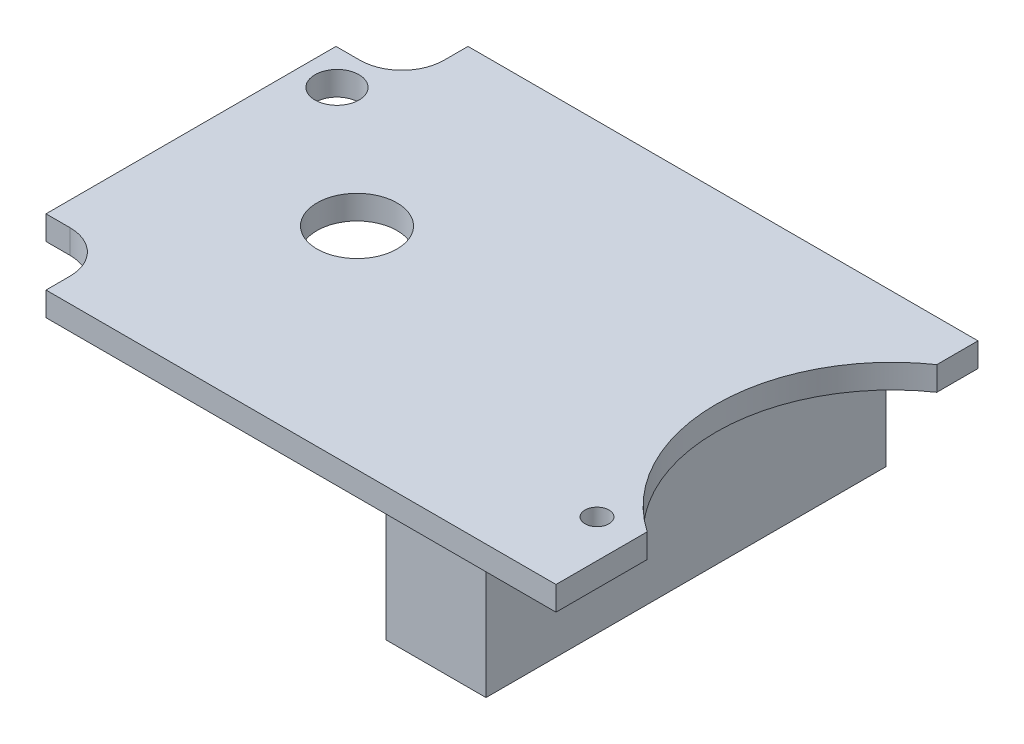
ISO-10303-21;
HEADER;
FILE_DESCRIPTION(('STEP AP214'),'2;1');
FILE_NAME('part.step','',(''),(''),'','','');
FILE_SCHEMA(('AUTOMOTIVE_DESIGN { 1 0 10303 214 1 1 1 1 }'));
ENDSEC;
DATA;
#1=APPLICATION_CONTEXT('core data for automotive mechanical design processes');
#2=APPLICATION_PROTOCOL_DEFINITION('international standard','automotive_design',2000,#1);
#3=PRODUCT_CONTEXT('',#1,'mechanical');
#4=PRODUCT('Part','Part','',(#3));
#5=PRODUCT_RELATED_PRODUCT_CATEGORY('part','',(#4));
#6=PRODUCT_DEFINITION_FORMATION('','',#4);
#7=PRODUCT_DEFINITION_CONTEXT('part definition',#1,'design');
#8=PRODUCT_DEFINITION('design','',#6,#7);
#9=PRODUCT_DEFINITION_SHAPE('','',#8);
#10=(LENGTH_UNIT() NAMED_UNIT(*) SI_UNIT(.MILLI.,.METRE.));
#11=(NAMED_UNIT(*) PLANE_ANGLE_UNIT() SI_UNIT($,.RADIAN.));
#12=(NAMED_UNIT(*) SI_UNIT($,.STERADIAN.) SOLID_ANGLE_UNIT());
#13=UNCERTAINTY_MEASURE_WITH_UNIT(LENGTH_MEASURE(1.E-05),#10,'distance_accuracy_value','');
#14=(GEOMETRIC_REPRESENTATION_CONTEXT(3) GLOBAL_UNCERTAINTY_ASSIGNED_CONTEXT((#13)) GLOBAL_UNIT_ASSIGNED_CONTEXT((#10,
#11,#12)) REPRESENTATION_CONTEXT('',''));
#15=CARTESIAN_POINT('',(0.,0.,0.));
#16=DIRECTION('',(0.,0.,1.));
#17=DIRECTION('',(1.,0.,0.));
#18=AXIS2_PLACEMENT_3D('',#15,#16,#17);
#19=CARTESIAN_POINT('',(-9.05,-20.5,8.));
#20=DIRECTION('',(-1.,0.,0.));
#21=DIRECTION('',(0.,0.,1.));
#22=AXIS2_PLACEMENT_3D('',#19,#20,#21);
#23=PLANE('',#22);
#24=DIRECTION('',(0.,0.,1.));
#25=VECTOR('',#24,1.);
#26=CARTESIAN_POINT('',(-9.05,-20.5,-10.));
#27=LINE('',#26,#25);
#28=CARTESIAN_POINT('',(-9.05,-20.5,-10.));
#29=VERTEX_POINT('',#28);
#30=CARTESIAN_POINT('',(-9.05,-20.5,10.));
#31=VERTEX_POINT('',#30);
#32=EDGE_CURVE('E211',#29,#31,#27,.T.);
#33=ORIENTED_EDGE('',*,*,#32,.F.);
#34=DIRECTION('',(0.,-1.,0.));
#35=VECTOR('',#34,1.);
#36=CARTESIAN_POINT('',(-9.05,-14.5,-10.));
#37=LINE('',#36,#35);
#38=CARTESIAN_POINT('',(-9.05,-14.5,-10.));
#39=VERTEX_POINT('',#38);
#40=EDGE_CURVE('E207',#39,#29,#37,.T.);
#41=ORIENTED_EDGE('',*,*,#40,.F.);
#42=DIRECTION('',(0.,0.,1.));
#43=VECTOR('',#42,1.);
#44=CARTESIAN_POINT('',(-9.05,-14.5,-10.));
#45=LINE('',#44,#43);
#46=CARTESIAN_POINT('',(-9.05,-14.5,10.));
#47=VERTEX_POINT('',#46);
#48=EDGE_CURVE('E224',#39,#47,#45,.T.);
#49=ORIENTED_EDGE('',*,*,#48,.T.);
#50=DIRECTION('',(0.,-1.,0.));
#51=VECTOR('',#50,1.);
#52=CARTESIAN_POINT('',(-9.05,-14.5,10.));
#53=LINE('',#52,#51);
#54=EDGE_CURVE('E11',#47,#31,#53,.T.);
#55=ORIENTED_EDGE('',*,*,#54,.T.);
#56=EDGE_LOOP('',(#33,#41,#49,#55));
#57=FACE_BOUND('',#56,.T.);
#58=ADVANCED_FACE('F17',(#57),#23,.F.);
#59=CARTESIAN_POINT('',(-13.8,-20.5,10.));
#60=DIRECTION('',(0.,0.,-1.));
#61=DIRECTION('',(0.,-1.,0.));
#62=AXIS2_PLACEMENT_3D('',#59,#60,#61);
#63=PLANE('',#62);
#64=DIRECTION('',(-1.,0.,0.));
#65=VECTOR('',#64,1.);
#66=CARTESIAN_POINT('',(-9.05,-20.5,10.));
#67=LINE('',#66,#65);
#68=CARTESIAN_POINT('',(-14.05,-20.5,10.));
#69=VERTEX_POINT('',#68);
#70=EDGE_CURVE('E216',#31,#69,#67,.T.);
#71=ORIENTED_EDGE('',*,*,#70,.F.);
#72=ORIENTED_EDGE('',*,*,#54,.F.);
#73=DIRECTION('',(-1.,0.,0.));
#74=VECTOR('',#73,1.);
#75=CARTESIAN_POINT('',(-9.05,-14.5,10.));
#76=LINE('',#75,#74);
#77=CARTESIAN_POINT('',(-14.05,-14.5,10.));
#78=VERTEX_POINT('',#77);
#79=EDGE_CURVE('E255',#47,#78,#76,.T.);
#80=ORIENTED_EDGE('',*,*,#79,.T.);
#81=DIRECTION('',(0.,-1.,0.));
#82=VECTOR('',#81,1.);
#83=CARTESIAN_POINT('',(-14.05,-14.5,10.));
#84=LINE('',#83,#82);
#85=EDGE_CURVE('E28',#78,#69,#84,.T.);
#86=ORIENTED_EDGE('',*,*,#85,.T.);
#87=EDGE_LOOP('',(#71,#72,#80,#86));
#88=FACE_BOUND('',#87,.T.);
#89=ADVANCED_FACE('F615',(#88),#63,.F.);
#90=CARTESIAN_POINT('',(-14.05,-20.5,-8.));
#91=DIRECTION('',(1.,0.,0.));
#92=DIRECTION('',(0.,1.,0.));
#93=AXIS2_PLACEMENT_3D('',#90,#91,#92);
#94=PLANE('',#93);
#95=DIRECTION('',(0.,0.,-1.));
#96=VECTOR('',#95,1.);
#97=CARTESIAN_POINT('',(-14.05,-20.5,10.));
#98=LINE('',#97,#96);
#99=CARTESIAN_POINT('',(-14.05,-20.5,-10.));
#100=VERTEX_POINT('',#99);
#101=EDGE_CURVE('E183',#69,#100,#98,.T.);
#102=ORIENTED_EDGE('',*,*,#101,.F.);
#103=ORIENTED_EDGE('',*,*,#85,.F.);
#104=DIRECTION('',(0.,0.,-1.));
#105=VECTOR('',#104,1.);
#106=CARTESIAN_POINT('',(-14.05,-14.5,10.));
#107=LINE('',#106,#105);
#108=CARTESIAN_POINT('',(-14.05,-14.5,-10.));
#109=VERTEX_POINT('',#108);
#110=EDGE_CURVE('E258',#78,#109,#107,.T.);
#111=ORIENTED_EDGE('',*,*,#110,.T.);
#112=DIRECTION('',(0.,-1.,0.));
#113=VECTOR('',#112,1.);
#114=CARTESIAN_POINT('',(-14.05,-14.5,-10.));
#115=LINE('',#114,#113);
#116=EDGE_CURVE('E212',#109,#100,#115,.T.);
#117=ORIENTED_EDGE('',*,*,#116,.T.);
#118=EDGE_LOOP('',(#102,#103,#111,#117));
#119=FACE_BOUND('',#118,.T.);
#120=ADVANCED_FACE('F605',(#119),#94,.F.);
#121=CARTESIAN_POINT('',(0.,-20.5,0.));
#122=DIRECTION('',(0.,-1.,0.));
#123=DIRECTION('',(0.,0.,-1.));
#124=AXIS2_PLACEMENT_3D('',#121,#122,#123);
#125=PLANE('',#124);
#126=DIRECTION('',(1.,0.,0.));
#127=VECTOR('',#126,1.);
#128=CARTESIAN_POINT('',(-14.05,-20.5,-10.));
#129=LINE('',#128,#127);
#130=EDGE_CURVE('E319',#100,#29,#129,.T.);
#131=ORIENTED_EDGE('',*,*,#130,.T.);
#132=ORIENTED_EDGE('',*,*,#32,.T.);
#133=ORIENTED_EDGE('',*,*,#70,.T.);
#134=ORIENTED_EDGE('',*,*,#101,.T.);
#135=EDGE_LOOP('',(#131,#132,#133,#134));
#136=FACE_BOUND('',#135,.T.);
#137=ADVANCED_FACE('F614',(#136),#125,.T.);
#138=CARTESIAN_POINT('',(-9.3,-20.5,-10.));
#139=DIRECTION('',(0.,0.,1.));
#140=DIRECTION('',(1.,0.,0.));
#141=AXIS2_PLACEMENT_3D('',#138,#139,#140);
#142=PLANE('',#141);
#143=ORIENTED_EDGE('',*,*,#130,.F.);
#144=ORIENTED_EDGE('',*,*,#116,.F.);
#145=DIRECTION('',(1.,0.,0.));
#146=VECTOR('',#145,1.);
#147=CARTESIAN_POINT('',(-14.05,-14.5,-10.));
#148=LINE('',#147,#146);
#149=EDGE_CURVE('E536',#109,#39,#148,.T.);
#150=ORIENTED_EDGE('',*,*,#149,.T.);
#151=ORIENTED_EDGE('',*,*,#40,.T.);
#152=EDGE_LOOP('',(#143,#144,#150,#151));
#153=FACE_BOUND('',#152,.T.);
#154=ADVANCED_FACE('F612',(#153),#142,.F.);
#155=CARTESIAN_POINT('',(-6.9,-19.,6.6));
#156=DIRECTION('',(0.,-1.,0.));
#157=DIRECTION('',(-1.,0.,0.));
#158=AXIS2_PLACEMENT_3D('',#155,#156,#157);
#159=CYLINDRICAL_SURFACE('',#158,0.6);
#160=CARTESIAN_POINT('',(-6.9,-13.3,6.6));
#161=DIRECTION('',(0.,1.,0.));
#162=DIRECTION('',(1.,0.,0.));
#163=AXIS2_PLACEMENT_3D('',#160,#161,#162);
#164=CIRCLE('',#163,0.6);
#165=CARTESIAN_POINT('',(-6.3,-13.3,6.6));
#166=VERTEX_POINT('',#165);
#167=EDGE_CURVE('E225',#166,#166,#164,.T.);
#168=ORIENTED_EDGE('',*,*,#167,.T.);
#169=DIRECTION('',(0.,-1.,0.));
#170=VECTOR('',#169,1.);
#171=CARTESIAN_POINT('',(-6.3,-19.,6.6));
#172=LINE('',#171,#170);
#173=CARTESIAN_POINT('',(-6.3,-14.5,6.6));
#174=VERTEX_POINT('',#173);
#175=EDGE_CURVE('E322',#166,#174,#172,.T.);
#176=ORIENTED_EDGE('',*,*,#175,.T.);
#177=CARTESIAN_POINT('',(-6.9,-14.5,6.6));
#178=DIRECTION('',(0.,-1.,0.));
#179=DIRECTION('',(-1.,0.,0.));
#180=AXIS2_PLACEMENT_3D('',#177,#178,#179);
#181=CIRCLE('',#180,0.6);
#182=EDGE_CURVE('E189',#174,#174,#181,.T.);
#183=ORIENTED_EDGE('',*,*,#182,.T.);
#184=ORIENTED_EDGE('',*,*,#175,.F.);
#185=EDGE_LOOP('',(#168,#176,#183,#184));
#186=FACE_BOUND('',#185,.T.);
#187=ADVANCED_FACE('F634',(#186),#159,.F.);
#188=CARTESIAN_POINT('',(-25.5,-19.,0.));
#189=DIRECTION('',(0.,-1.,0.));
#190=DIRECTION('',(-1.,0.,0.));
#191=AXIS2_PLACEMENT_3D('',#188,#189,#190);
#192=CYLINDRICAL_SURFACE('',#191,2.);
#193=CARTESIAN_POINT('',(-25.5,-13.3,0.));
#194=DIRECTION('',(0.,1.,0.));
#195=DIRECTION('',(1.,0.,0.));
#196=AXIS2_PLACEMENT_3D('',#193,#194,#195);
#197=CIRCLE('',#196,2.);
#198=CARTESIAN_POINT('',(-23.5,-13.3,0.));
#199=VERTEX_POINT('',#198);
#200=EDGE_CURVE('E205',#199,#199,#197,.T.);
#201=ORIENTED_EDGE('',*,*,#200,.T.);
#202=DIRECTION('',(0.,-1.,0.));
#203=VECTOR('',#202,1.);
#204=CARTESIAN_POINT('',(-23.5,-19.,0.));
#205=LINE('',#204,#203);
#206=CARTESIAN_POINT('',(-23.5,-14.5,0.));
#207=VERTEX_POINT('',#206);
#208=EDGE_CURVE('E512',#199,#207,#205,.T.);
#209=ORIENTED_EDGE('',*,*,#208,.T.);
#210=CARTESIAN_POINT('',(-25.5,-14.5,0.));
#211=DIRECTION('',(0.,-1.,0.));
#212=DIRECTION('',(-1.,0.,0.));
#213=AXIS2_PLACEMENT_3D('',#210,#211,#212);
#214=CIRCLE('',#213,2.);
#215=EDGE_CURVE('E188',#207,#207,#214,.T.);
#216=ORIENTED_EDGE('',*,*,#215,.T.);
#217=ORIENTED_EDGE('',*,*,#208,.F.);
#218=EDGE_LOOP('',(#201,#209,#216,#217));
#219=FACE_BOUND('',#218,.T.);
#220=ADVANCED_FACE('F637',(#219),#192,.F.);
#221=CARTESIAN_POINT('',(-32.,-19.,-5.5));
#222=DIRECTION('',(0.,-1.,0.));
#223=DIRECTION('',(-1.,0.,0.));
#224=AXIS2_PLACEMENT_3D('',#221,#222,#223);
#225=CYLINDRICAL_SURFACE('',#224,1.1);
#226=CARTESIAN_POINT('',(-32.,-13.3,-5.5));
#227=DIRECTION('',(0.,1.,0.));
#228=DIRECTION('',(1.,0.,0.));
#229=AXIS2_PLACEMENT_3D('',#226,#227,#228);
#230=CIRCLE('',#229,1.1);
#231=CARTESIAN_POINT('',(-30.9,-13.3,-5.5));
#232=VERTEX_POINT('',#231);
#233=EDGE_CURVE('E201',#232,#232,#230,.T.);
#234=ORIENTED_EDGE('',*,*,#233,.T.);
#235=DIRECTION('',(0.,-1.,0.));
#236=VECTOR('',#235,1.);
#237=CARTESIAN_POINT('',(-30.9,-19.,-5.5));
#238=LINE('',#237,#236);
#239=CARTESIAN_POINT('',(-30.9,-14.5,-5.5));
#240=VERTEX_POINT('',#239);
#241=EDGE_CURVE('E519',#232,#240,#238,.T.);
#242=ORIENTED_EDGE('',*,*,#241,.T.);
#243=CARTESIAN_POINT('',(-32.,-14.5,-5.5));
#244=DIRECTION('',(0.,-1.,0.));
#245=DIRECTION('',(-1.,0.,0.));
#246=AXIS2_PLACEMENT_3D('',#243,#244,#245);
#247=CIRCLE('',#246,1.1);
#248=EDGE_CURVE('E184',#240,#240,#247,.T.);
#249=ORIENTED_EDGE('',*,*,#248,.T.);
#250=ORIENTED_EDGE('',*,*,#241,.F.);
#251=EDGE_LOOP('',(#234,#242,#249,#250));
#252=FACE_BOUND('',#251,.T.);
#253=ADVANCED_FACE('F627',(#252),#225,.F.);
#254=CARTESIAN_POINT('',(-32.6,-13.3,7.25));
#255=DIRECTION('',(0.,0.,-1.));
#256=DIRECTION('',(0.,-1.,0.));
#257=AXIS2_PLACEMENT_3D('',#254,#255,#256);
#258=PLANE('',#257);
#259=DIRECTION('',(-1.,0.,0.));
#260=VECTOR('',#259,1.);
#261=CARTESIAN_POINT('',(-32.6,-14.5,7.25));
#262=LINE('',#261,#260);
#263=CARTESIAN_POINT('',(-32.6,-14.5,7.25));
#264=VERTEX_POINT('',#263);
#265=CARTESIAN_POINT('',(-33.8,-14.5,7.25));
#266=VERTEX_POINT('',#265);
#267=EDGE_CURVE('E163',#264,#266,#262,.T.);
#268=ORIENTED_EDGE('',*,*,#267,.F.);
#269=DIRECTION('',(0.,1.,0.));
#270=VECTOR('',#269,1.);
#271=CARTESIAN_POINT('',(-32.6,-14.5,7.25));
#272=LINE('',#271,#270);
#273=CARTESIAN_POINT('',(-32.6,-13.3,7.25));
#274=VERTEX_POINT('',#273);
#275=EDGE_CURVE('E153',#264,#274,#272,.T.);
#276=ORIENTED_EDGE('',*,*,#275,.T.);
#277=DIRECTION('',(-1.,0.,0.));
#278=VECTOR('',#277,1.);
#279=CARTESIAN_POINT('',(-32.6,-13.3,7.25));
#280=LINE('',#279,#278);
#281=CARTESIAN_POINT('',(-33.8,-13.3,7.25));
#282=VERTEX_POINT('',#281);
#283=EDGE_CURVE('E196',#274,#282,#280,.T.);
#284=ORIENTED_EDGE('',*,*,#283,.T.);
#285=DIRECTION('',(0.,1.,0.));
#286=VECTOR('',#285,1.);
#287=CARTESIAN_POINT('',(-33.8,-14.5,7.25));
#288=LINE('',#287,#286);
#289=EDGE_CURVE('E271',#266,#282,#288,.T.);
#290=ORIENTED_EDGE('',*,*,#289,.F.);
#291=EDGE_LOOP('',(#268,#276,#284,#290));
#292=FACE_BOUND('',#291,.T.);
#293=ADVANCED_FACE('F396',(#292),#258,.F.);
#294=CARTESIAN_POINT('',(-32.6,-15.1,9.35));
#295=DIRECTION('',(0.,1.,0.));
#296=DIRECTION('',(1.,0.,0.));
#297=AXIS2_PLACEMENT_3D('',#294,#295,#296);
#298=CYLINDRICAL_SURFACE('',#297,2.1);
#299=ORIENTED_EDGE('',*,*,#275,.F.);
#300=CARTESIAN_POINT('',(-32.6,-14.5,9.35));
#301=DIRECTION('',(0.,-1.,0.));
#302=DIRECTION('',(0.,0.,-1.));
#303=AXIS2_PLACEMENT_3D('',#300,#301,#302);
#304=CIRCLE('',#303,2.1);
#305=CARTESIAN_POINT('',(-30.5,-14.5,9.35));
#306=VERTEX_POINT('',#305);
#307=EDGE_CURVE('E156',#264,#306,#304,.T.);
#308=ORIENTED_EDGE('',*,*,#307,.T.);
#309=DIRECTION('',(0.,-1.,0.));
#310=VECTOR('',#309,1.);
#311=CARTESIAN_POINT('',(-30.5,-13.3,9.35));
#312=LINE('',#311,#310);
#313=CARTESIAN_POINT('',(-30.5,-13.3,9.35));
#314=VERTEX_POINT('',#313);
#315=EDGE_CURVE('E142',#314,#306,#312,.T.);
#316=ORIENTED_EDGE('',*,*,#315,.F.);
#317=CARTESIAN_POINT('',(-32.6,-13.3,9.35));
#318=DIRECTION('',(0.,1.,0.));
#319=DIRECTION('',(1.,0.,0.));
#320=AXIS2_PLACEMENT_3D('',#317,#318,#319);
#321=CIRCLE('',#320,2.1);
#322=EDGE_CURVE('E199',#314,#274,#321,.T.);
#323=ORIENTED_EDGE('',*,*,#322,.T.);
#324=EDGE_LOOP('',(#299,#308,#316,#323));
#325=FACE_BOUND('',#324,.T.);
#326=ADVANCED_FACE('F157',(#325),#298,.F.);
#327=CARTESIAN_POINT('',(-30.5,-13.3,12.09309179819));
#328=DIRECTION('',(1.,0.,0.));
#329=DIRECTION('',(0.,1.,0.));
#330=AXIS2_PLACEMENT_3D('',#327,#328,#329);
#331=PLANE('',#330);
#332=DIRECTION('',(0.,1.,0.));
#333=VECTOR('',#332,1.);
#334=CARTESIAN_POINT('',(-30.5,-14.5,10.55));
#335=LINE('',#334,#333);
#336=CARTESIAN_POINT('',(-30.5,-14.5,10.55));
#337=VERTEX_POINT('',#336);
#338=CARTESIAN_POINT('',(-30.5,-13.3,10.55));
#339=VERTEX_POINT('',#338);
#340=EDGE_CURVE('E134',#337,#339,#335,.T.);
#341=ORIENTED_EDGE('',*,*,#340,.T.);
#342=DIRECTION('',(0.,0.,1.));
#343=VECTOR('',#342,1.);
#344=CARTESIAN_POINT('',(-30.5,-13.3,9.35));
#345=LINE('',#344,#343);
#346=EDGE_CURVE('E148',#314,#339,#345,.T.);
#347=ORIENTED_EDGE('',*,*,#346,.F.);
#348=ORIENTED_EDGE('',*,*,#315,.T.);
#349=DIRECTION('',(0.,0.,1.));
#350=VECTOR('',#349,1.);
#351=CARTESIAN_POINT('',(-30.5,-14.5,9.35));
#352=LINE('',#351,#350);
#353=EDGE_CURVE('E145',#306,#337,#352,.T.);
#354=ORIENTED_EDGE('',*,*,#353,.T.);
#355=EDGE_LOOP('',(#341,#347,#348,#354));
#356=FACE_BOUND('',#355,.T.);
#357=ADVANCED_FACE('F19',(#356),#331,.F.);
#358=CARTESIAN_POINT('',(-5.,-20.5,10.55));
#359=DIRECTION('',(0.,0.,1.));
#360=DIRECTION('',(1.,0.,0.));
#361=AXIS2_PLACEMENT_3D('',#358,#359,#360);
#362=PLANE('',#361);
#363=ORIENTED_EDGE('',*,*,#340,.F.);
#364=DIRECTION('',(1.,0.,0.));
#365=VECTOR('',#364,1.);
#366=CARTESIAN_POINT('',(-30.5,-14.5,10.55));
#367=LINE('',#366,#365);
#368=CARTESIAN_POINT('',(-5.,-14.5,10.55));
#369=VERTEX_POINT('',#368);
#370=EDGE_CURVE('E168',#337,#369,#367,.T.);
#371=ORIENTED_EDGE('',*,*,#370,.T.);
#372=DIRECTION('',(0.,-1.,0.));
#373=VECTOR('',#372,1.);
#374=CARTESIAN_POINT('',(-5.,-13.3,10.55));
#375=LINE('',#374,#373);
#376=CARTESIAN_POINT('',(-5.,-13.3,10.55));
#377=VERTEX_POINT('',#376);
#378=EDGE_CURVE('E231',#377,#369,#375,.T.);
#379=ORIENTED_EDGE('',*,*,#378,.F.);
#380=DIRECTION('',(1.,0.,0.));
#381=VECTOR('',#380,1.);
#382=CARTESIAN_POINT('',(-30.5,-13.3,10.55));
#383=LINE('',#382,#381);
#384=EDGE_CURVE('E275',#339,#377,#383,.T.);
#385=ORIENTED_EDGE('',*,*,#384,.F.);
#386=EDGE_LOOP('',(#363,#371,#379,#385));
#387=FACE_BOUND('',#386,.T.);
#388=ADVANCED_FACE('F641',(#387),#362,.T.);
#389=CARTESIAN_POINT('',(-5.,-20.5,-10.));
#390=DIRECTION('',(1.,0.,0.));
#391=DIRECTION('',(0.,1.,0.));
#392=AXIS2_PLACEMENT_3D('',#389,#390,#391);
#393=PLANE('',#392);
#394=DIRECTION('',(0.,1.,0.));
#395=VECTOR('',#394,1.);
#396=CARTESIAN_POINT('',(-5.,-14.5,5.991546796093));
#397=LINE('',#396,#395);
#398=CARTESIAN_POINT('',(-5.,-14.5,5.991546796093));
#399=VERTEX_POINT('',#398);
#400=CARTESIAN_POINT('',(-5.,-13.3,5.991546796093));
#401=VERTEX_POINT('',#400);
#402=EDGE_CURVE('E248',#399,#401,#397,.T.);
#403=ORIENTED_EDGE('',*,*,#402,.T.);
#404=DIRECTION('',(0.,0.,-1.));
#405=VECTOR('',#404,1.);
#406=CARTESIAN_POINT('',(-5.,-13.3,10.55));
#407=LINE('',#406,#405);
#408=EDGE_CURVE('E179',#377,#401,#407,.T.);
#409=ORIENTED_EDGE('',*,*,#408,.F.);
#410=ORIENTED_EDGE('',*,*,#378,.T.);
#411=DIRECTION('',(0.,0.,-1.));
#412=VECTOR('',#411,1.);
#413=CARTESIAN_POINT('',(-5.,-14.5,10.55));
#414=LINE('',#413,#412);
#415=EDGE_CURVE('E175',#369,#399,#414,.T.);
#416=ORIENTED_EDGE('',*,*,#415,.T.);
#417=EDGE_LOOP('',(#403,#409,#410,#416));
#418=FACE_BOUND('',#417,.T.);
#419=ADVANCED_FACE('F644',(#418),#393,.T.);
#420=CARTESIAN_POINT('',(-34.,-20.5,-10.55));
#421=DIRECTION('',(0.,0.,-1.));
#422=DIRECTION('',(0.,-1.,0.));
#423=AXIS2_PLACEMENT_3D('',#420,#421,#422);
#424=PLANE('',#423);
#425=DIRECTION('',(0.,1.,0.));
#426=VECTOR('',#425,1.);
#427=CARTESIAN_POINT('',(-30.5,-14.5,-10.55));
#428=LINE('',#427,#426);
#429=CARTESIAN_POINT('',(-30.5,-14.5,-10.55));
#430=VERTEX_POINT('',#429);
#431=CARTESIAN_POINT('',(-30.5,-13.3,-10.55));
#432=VERTEX_POINT('',#431);
#433=EDGE_CURVE('E252',#430,#432,#428,.T.);
#434=ORIENTED_EDGE('',*,*,#433,.T.);
#435=DIRECTION('',(-1.,0.,0.));
#436=VECTOR('',#435,1.);
#437=CARTESIAN_POINT('',(-5.,-13.3,-10.55));
#438=LINE('',#437,#436);
#439=CARTESIAN_POINT('',(-5.,-13.3,-10.55));
#440=VERTEX_POINT('',#439);
#441=EDGE_CURVE('E284',#440,#432,#438,.T.);
#442=ORIENTED_EDGE('',*,*,#441,.F.);
#443=DIRECTION('',(0.,-1.,0.));
#444=VECTOR('',#443,1.);
#445=CARTESIAN_POINT('',(-5.,-13.3,-10.55));
#446=LINE('',#445,#444);
#447=CARTESIAN_POINT('',(-5.,-14.5,-10.55));
#448=VERTEX_POINT('',#447);
#449=EDGE_CURVE('E238',#440,#448,#446,.T.);
#450=ORIENTED_EDGE('',*,*,#449,.T.);
#451=DIRECTION('',(-1.,0.,0.));
#452=VECTOR('',#451,1.);
#453=CARTESIAN_POINT('',(-5.,-14.5,-10.55));
#454=LINE('',#453,#452);
#455=EDGE_CURVE('E270',#448,#430,#454,.T.);
#456=ORIENTED_EDGE('',*,*,#455,.T.);
#457=EDGE_LOOP('',(#434,#442,#450,#456));
#458=FACE_BOUND('',#457,.T.);
#459=ADVANCED_FACE('F648',(#458),#424,.T.);
#460=CARTESIAN_POINT('',(-30.5,-13.3,-9.35));
#461=DIRECTION('',(1.,0.,0.));
#462=DIRECTION('',(0.,1.,0.));
#463=AXIS2_PLACEMENT_3D('',#460,#461,#462);
#464=PLANE('',#463);
#465=DIRECTION('',(0.,0.,-1.));
#466=VECTOR('',#465,1.);
#467=CARTESIAN_POINT('',(-30.5,-14.5,-9.35));
#468=LINE('',#467,#466);
#469=CARTESIAN_POINT('',(-30.5,-14.5,-9.35));
#470=VERTEX_POINT('',#469);
#471=EDGE_CURVE('E266',#470,#430,#468,.T.);
#472=ORIENTED_EDGE('',*,*,#471,.F.);
#473=DIRECTION('',(0.,1.,0.));
#474=VECTOR('',#473,1.);
#475=CARTESIAN_POINT('',(-30.5,-14.5,-9.35));
#476=LINE('',#475,#474);
#477=CARTESIAN_POINT('',(-30.5,-13.3,-9.35));
#478=VERTEX_POINT('',#477);
#479=EDGE_CURVE('E229',#470,#478,#476,.T.);
#480=ORIENTED_EDGE('',*,*,#479,.T.);
#481=DIRECTION('',(0.,0.,-1.));
#482=VECTOR('',#481,1.);
#483=CARTESIAN_POINT('',(-30.5,-13.3,-9.35));
#484=LINE('',#483,#482);
#485=EDGE_CURVE('E220',#478,#432,#484,.T.);
#486=ORIENTED_EDGE('',*,*,#485,.T.);
#487=ORIENTED_EDGE('',*,*,#433,.F.);
#488=EDGE_LOOP('',(#472,#480,#486,#487));
#489=FACE_BOUND('',#488,.T.);
#490=ADVANCED_FACE('F645',(#489),#464,.F.);
#491=CARTESIAN_POINT('',(-32.6,-15.1,-9.35));
#492=DIRECTION('',(0.,1.,0.));
#493=DIRECTION('',(1.,0.,0.));
#494=AXIS2_PLACEMENT_3D('',#491,#492,#493);
#495=CYLINDRICAL_SURFACE('',#494,2.1);
#496=DIRECTION('',(0.,-1.,0.));
#497=VECTOR('',#496,1.);
#498=CARTESIAN_POINT('',(-32.6,-13.3,-7.25));
#499=LINE('',#498,#497);
#500=CARTESIAN_POINT('',(-32.6,-13.3,-7.25));
#501=VERTEX_POINT('',#500);
#502=CARTESIAN_POINT('',(-32.6,-14.5,-7.25));
#503=VERTEX_POINT('',#502);
#504=EDGE_CURVE('E194',#501,#503,#499,.T.);
#505=ORIENTED_EDGE('',*,*,#504,.F.);
#506=CARTESIAN_POINT('',(-32.6,-13.3,-9.35));
#507=DIRECTION('',(0.,1.,0.));
#508=DIRECTION('',(0.,0.,1.));
#509=AXIS2_PLACEMENT_3D('',#506,#507,#508);
#510=CIRCLE('',#509,2.1);
#511=EDGE_CURVE('E206',#501,#478,#510,.T.);
#512=ORIENTED_EDGE('',*,*,#511,.T.);
#513=ORIENTED_EDGE('',*,*,#479,.F.);
#514=CARTESIAN_POINT('',(-32.6,-14.5,-9.35));
#515=DIRECTION('',(0.,-1.,0.));
#516=DIRECTION('',(1.,0.,0.));
#517=AXIS2_PLACEMENT_3D('',#514,#515,#516);
#518=CIRCLE('',#517,2.1);
#519=EDGE_CURVE('E247',#470,#503,#518,.T.);
#520=ORIENTED_EDGE('',*,*,#519,.T.);
#521=EDGE_LOOP('',(#505,#512,#513,#520));
#522=FACE_BOUND('',#521,.T.);
#523=ADVANCED_FACE('F332',(#522),#495,.F.);
#524=CARTESIAN_POINT('',(0.,-13.3,0.));
#525=DIRECTION('',(0.,-1.,0.));
#526=DIRECTION('',(0.,0.,-1.));
#527=AXIS2_PLACEMENT_3D('',#524,#525,#526);
#528=PLANE('',#527);
#529=ORIENTED_EDGE('',*,*,#167,.F.);
#530=EDGE_LOOP('',(#529));
#531=FACE_BOUND('',#530,.T.);
#532=ORIENTED_EDGE('',*,*,#200,.F.);
#533=EDGE_LOOP('',(#532));
#534=FACE_BOUND('',#533,.T.);
#535=ORIENTED_EDGE('',*,*,#233,.F.);
#536=EDGE_LOOP('',(#535));
#537=FACE_BOUND('',#536,.T.);
#538=DIRECTION('',(-1.,0.,0.));
#539=VECTOR('',#538,1.);
#540=CARTESIAN_POINT('',(-32.6,-13.3,-7.25));
#541=LINE('',#540,#539);
#542=CARTESIAN_POINT('',(-33.8,-13.3,-7.25));
#543=VERTEX_POINT('',#542);
#544=EDGE_CURVE('E190',#501,#543,#541,.T.);
#545=ORIENTED_EDGE('',*,*,#544,.T.);
#546=DIRECTION('',(0.,0.,1.));
#547=VECTOR('',#546,1.);
#548=CARTESIAN_POINT('',(-33.8,-13.3,-7.25));
#549=LINE('',#548,#547);
#550=EDGE_CURVE('E200',#543,#282,#549,.T.);
#551=ORIENTED_EDGE('',*,*,#550,.T.);
#552=ORIENTED_EDGE('',*,*,#283,.F.);
#553=ORIENTED_EDGE('',*,*,#322,.F.);
#554=ORIENTED_EDGE('',*,*,#346,.T.);
#555=ORIENTED_EDGE('',*,*,#384,.T.);
#556=ORIENTED_EDGE('',*,*,#408,.T.);
#557=CARTESIAN_POINT('',(0.,-13.3,-1.25));
#558=DIRECTION('',(0.,1.,0.));
#559=DIRECTION('',(-0.56818181818182,0.,-0.822903045010529));
#560=AXIS2_PLACEMENT_3D('',#557,#558,#559);
#561=CIRCLE('',#560,8.8);
#562=CARTESIAN_POINT('',(-5.,-13.3,-8.491546796093));
#563=VERTEX_POINT('',#562);
#564=EDGE_CURVE('E251',#563,#401,#561,.T.);
#565=ORIENTED_EDGE('',*,*,#564,.F.);
#566=DIRECTION('',(0.,0.,-1.));
#567=VECTOR('',#566,1.);
#568=CARTESIAN_POINT('',(-5.,-13.3,-8.491546796093));
#569=LINE('',#568,#567);
#570=EDGE_CURVE('E233',#563,#440,#569,.T.);
#571=ORIENTED_EDGE('',*,*,#570,.T.);
#572=ORIENTED_EDGE('',*,*,#441,.T.);
#573=ORIENTED_EDGE('',*,*,#485,.F.);
#574=ORIENTED_EDGE('',*,*,#511,.F.);
#575=EDGE_LOOP('',(#545,#551,#552,#553,#554,#555,#556,#565,#571,#572,#573,#574));
#576=FACE_BOUND('',#575,.T.);
#577=ADVANCED_FACE('F368',(#531,#534,#537,#576),#528,.F.);
#578=CARTESIAN_POINT('',(-33.8,-20.5,10.));
#579=DIRECTION('',(-1.,0.,0.));
#580=DIRECTION('',(0.,0.,1.));
#581=AXIS2_PLACEMENT_3D('',#578,#579,#580);
#582=PLANE('',#581);
#583=DIRECTION('',(0.,1.,0.));
#584=VECTOR('',#583,1.);
#585=CARTESIAN_POINT('',(-33.8,-14.5,-7.25));
#586=LINE('',#585,#584);
#587=CARTESIAN_POINT('',(-33.8,-14.5,-7.25));
#588=VERTEX_POINT('',#587);
#589=EDGE_CURVE('E195',#588,#543,#586,.T.);
#590=ORIENTED_EDGE('',*,*,#589,.F.);
#591=DIRECTION('',(0.,0.,1.));
#592=VECTOR('',#591,1.);
#593=CARTESIAN_POINT('',(-33.8,-14.5,-7.25));
#594=LINE('',#593,#592);
#595=EDGE_CURVE('E21',#588,#266,#594,.T.);
#596=ORIENTED_EDGE('',*,*,#595,.T.);
#597=ORIENTED_EDGE('',*,*,#289,.T.);
#598=ORIENTED_EDGE('',*,*,#550,.F.);
#599=EDGE_LOOP('',(#590,#596,#597,#598));
#600=FACE_BOUND('',#599,.T.);
#601=ADVANCED_FACE('F398',(#600),#582,.T.);
#602=CARTESIAN_POINT('',(-37.39248662508,-13.3,-7.25));
#603=DIRECTION('',(0.,0.,1.));
#604=DIRECTION('',(1.,0.,0.));
#605=AXIS2_PLACEMENT_3D('',#602,#603,#604);
#606=PLANE('',#605);
#607=ORIENTED_EDGE('',*,*,#589,.T.);
#608=ORIENTED_EDGE('',*,*,#544,.F.);
#609=ORIENTED_EDGE('',*,*,#504,.T.);
#610=DIRECTION('',(-1.,0.,0.));
#611=VECTOR('',#610,1.);
#612=CARTESIAN_POINT('',(-32.6,-14.5,-7.25));
#613=LINE('',#612,#611);
#614=EDGE_CURVE('E243',#503,#588,#613,.T.);
#615=ORIENTED_EDGE('',*,*,#614,.T.);
#616=EDGE_LOOP('',(#607,#608,#609,#615));
#617=FACE_BOUND('',#616,.T.);
#618=ADVANCED_FACE('F342',(#617),#606,.F.);
#619=CARTESIAN_POINT('',(0.,-14.5,0.));
#620=DIRECTION('',(0.,-1.,0.));
#621=DIRECTION('',(0.,0.,-1.));
#622=AXIS2_PLACEMENT_3D('',#619,#620,#621);
#623=PLANE('',#622);
#624=ORIENTED_EDGE('',*,*,#149,.F.);
#625=ORIENTED_EDGE('',*,*,#110,.F.);
#626=ORIENTED_EDGE('',*,*,#79,.F.);
#627=ORIENTED_EDGE('',*,*,#48,.F.);
#628=EDGE_LOOP('',(#624,#625,#626,#627));
#629=FACE_BOUND('',#628,.T.);
#630=ORIENTED_EDGE('',*,*,#215,.F.);
#631=EDGE_LOOP('',(#630));
#632=FACE_BOUND('',#631,.T.);
#633=ORIENTED_EDGE('',*,*,#248,.F.);
#634=EDGE_LOOP('',(#633));
#635=FACE_BOUND('',#634,.T.);
#636=ORIENTED_EDGE('',*,*,#182,.F.);
#637=EDGE_LOOP('',(#636));
#638=FACE_BOUND('',#637,.T.);
#639=ORIENTED_EDGE('',*,*,#614,.F.);
#640=ORIENTED_EDGE('',*,*,#519,.F.);
#641=ORIENTED_EDGE('',*,*,#471,.T.);
#642=ORIENTED_EDGE('',*,*,#455,.F.);
#643=DIRECTION('',(0.,0.,-1.));
#644=VECTOR('',#643,1.);
#645=CARTESIAN_POINT('',(-5.,-14.5,-8.491546796093));
#646=LINE('',#645,#644);
#647=CARTESIAN_POINT('',(-5.,-14.5,-8.491546796093));
#648=VERTEX_POINT('',#647);
#649=EDGE_CURVE('E242',#648,#448,#646,.T.);
#650=ORIENTED_EDGE('',*,*,#649,.F.);
#651=CARTESIAN_POINT('',(0.,-14.5,-1.25));
#652=DIRECTION('',(0.,-1.,0.));
#653=DIRECTION('',(-1.,0.,0.));
#654=AXIS2_PLACEMENT_3D('',#651,#652,#653);
#655=CIRCLE('',#654,8.8);
#656=EDGE_CURVE('E237',#399,#648,#655,.T.);
#657=ORIENTED_EDGE('',*,*,#656,.F.);
#658=ORIENTED_EDGE('',*,*,#415,.F.);
#659=ORIENTED_EDGE('',*,*,#370,.F.);
#660=ORIENTED_EDGE('',*,*,#353,.F.);
#661=ORIENTED_EDGE('',*,*,#307,.F.);
#662=ORIENTED_EDGE('',*,*,#267,.T.);
#663=ORIENTED_EDGE('',*,*,#595,.F.);
#664=EDGE_LOOP('',(#639,#640,#641,#642,#650,#657,#658,#659,#660,#661,#662,#663));
#665=FACE_BOUND('',#664,.T.);
#666=ADVANCED_FACE('F166',(#629,#632,#635,#638,#665),#623,.T.);
#667=CARTESIAN_POINT('',(0.,-14.7,-1.25));
#668=DIRECTION('',(0.,-1.,0.));
#669=DIRECTION('',(-1.,0.,0.));
#670=AXIS2_PLACEMENT_3D('',#667,#668,#669);
#671=CYLINDRICAL_SURFACE('',#670,8.8);
#672=ORIENTED_EDGE('',*,*,#656,.T.);
#673=DIRECTION('',(0.,-1.,0.));
#674=VECTOR('',#673,1.);
#675=CARTESIAN_POINT('',(-5.,-13.3,-8.491546796093));
#676=LINE('',#675,#674);
#677=EDGE_CURVE('E262',#563,#648,#676,.T.);
#678=ORIENTED_EDGE('',*,*,#677,.F.);
#679=ORIENTED_EDGE('',*,*,#564,.T.);
#680=ORIENTED_EDGE('',*,*,#402,.F.);
#681=EDGE_LOOP('',(#672,#678,#679,#680));
#682=FACE_BOUND('',#681,.T.);
#683=ADVANCED_FACE('F377',(#682),#671,.F.);
#684=CARTESIAN_POINT('',(-5.,-20.5,-10.));
#685=DIRECTION('',(1.,0.,0.));
#686=DIRECTION('',(0.,1.,0.));
#687=AXIS2_PLACEMENT_3D('',#684,#685,#686);
#688=PLANE('',#687);
#689=ORIENTED_EDGE('',*,*,#677,.T.);
#690=ORIENTED_EDGE('',*,*,#649,.T.);
#691=ORIENTED_EDGE('',*,*,#449,.F.);
#692=ORIENTED_EDGE('',*,*,#570,.F.);
#693=EDGE_LOOP('',(#689,#690,#691,#692));
#694=FACE_BOUND('',#693,.T.);
#695=ADVANCED_FACE('F376',(#694),#688,.T.);
#696=CLOSED_SHELL('',(#58,#89,#120,#137,#154,#187,#220,#253,#293,#326,#357,#388,#419,#459,#490,
#523,#577,#601,#618,#666,#683,#695));
#697=MANIFOLD_SOLID_BREP('B1',#696);
#698=ADVANCED_BREP_SHAPE_REPRESENTATION('',(#18,#697),#14);
#699=SHAPE_DEFINITION_REPRESENTATION(#9,#698);
ENDSEC;
END-ISO-10303-21;
